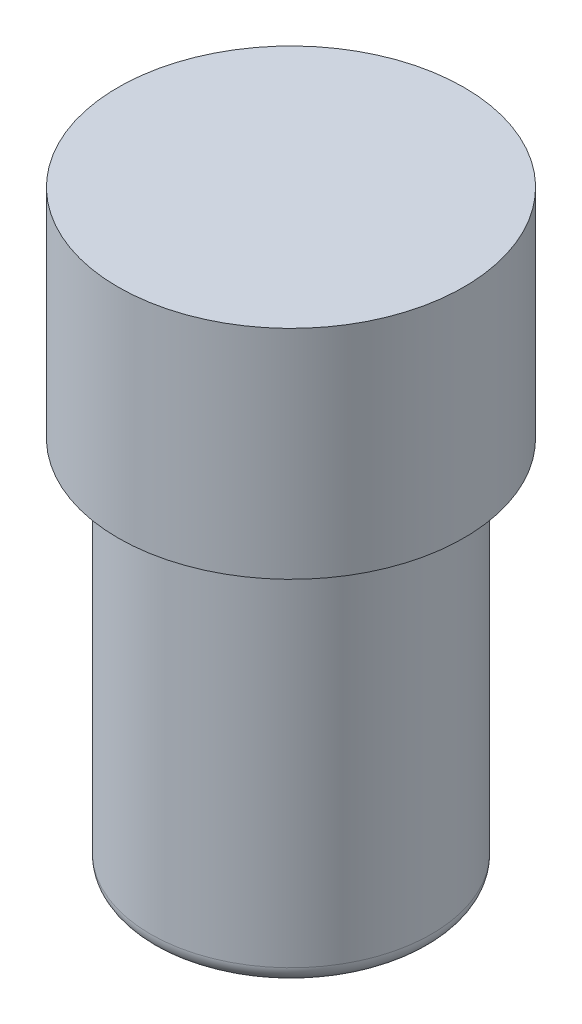
ISO-10303-21;
HEADER;
FILE_DESCRIPTION(('STEP AP214'),'2;1');
FILE_NAME('part.step','',(''),(''),'','','');
FILE_SCHEMA(('AUTOMOTIVE_DESIGN { 1 0 10303 214 1 1 1 1 }'));
ENDSEC;
DATA;
#1=APPLICATION_CONTEXT('core data for automotive mechanical design processes');
#2=APPLICATION_PROTOCOL_DEFINITION('international standard','automotive_design',2000,#1);
#3=PRODUCT_CONTEXT('',#1,'mechanical');
#4=PRODUCT('Part','Part','',(#3));
#5=PRODUCT_RELATED_PRODUCT_CATEGORY('part','',(#4));
#6=PRODUCT_DEFINITION_FORMATION('','',#4);
#7=PRODUCT_DEFINITION_CONTEXT('part definition',#1,'design');
#8=PRODUCT_DEFINITION('design','',#6,#7);
#9=PRODUCT_DEFINITION_SHAPE('','',#8);
#10=(LENGTH_UNIT() NAMED_UNIT(*) SI_UNIT(.MILLI.,.METRE.));
#11=(NAMED_UNIT(*) PLANE_ANGLE_UNIT() SI_UNIT($,.RADIAN.));
#12=(NAMED_UNIT(*) SI_UNIT($,.STERADIAN.) SOLID_ANGLE_UNIT());
#13=UNCERTAINTY_MEASURE_WITH_UNIT(LENGTH_MEASURE(1.E-05),#10,'distance_accuracy_value','');
#14=(GEOMETRIC_REPRESENTATION_CONTEXT(3) GLOBAL_UNCERTAINTY_ASSIGNED_CONTEXT((#13)) GLOBAL_UNIT_ASSIGNED_CONTEXT((#10,
#11,#12)) REPRESENTATION_CONTEXT('',''));
#15=CARTESIAN_POINT('',(0.,0.,0.));
#16=DIRECTION('',(0.,0.,1.));
#17=DIRECTION('',(1.,0.,0.));
#18=AXIS2_PLACEMENT_3D('',#15,#16,#17);
#19=CARTESIAN_POINT('',(0.,6.35,0.));
#20=DIRECTION('',(0.,-1.,0.));
#21=DIRECTION('',(0.,0.,-1.));
#22=AXIS2_PLACEMENT_3D('',#19,#20,#21);
#23=CYLINDRICAL_SURFACE('',#22,5.0535);
#24=CARTESIAN_POINT('',(0.,6.35,0.));
#25=DIRECTION('',(0.,1.,0.));
#26=DIRECTION('',(0.,0.,1.));
#27=AXIS2_PLACEMENT_3D('',#24,#25,#26);
#28=CIRCLE('',#27,5.0535);
#29=CARTESIAN_POINT('',(0.,6.35,5.0535));
#30=VERTEX_POINT('',#29);
#31=EDGE_CURVE('E53',#30,#30,#28,.T.);
#32=ORIENTED_EDGE('',*,*,#31,.F.);
#33=EDGE_LOOP('',(#32));
#34=FACE_BOUND('',#33,.T.);
#35=CARTESIAN_POINT('',(0.,0.,0.));
#36=DIRECTION('',(0.,1.,0.));
#37=DIRECTION('',(0.,0.,1.));
#38=AXIS2_PLACEMENT_3D('',#35,#36,#37);
#39=CIRCLE('',#38,5.0535);
#40=CARTESIAN_POINT('',(0.,0.,5.0535));
#41=VERTEX_POINT('',#40);
#42=EDGE_CURVE('E54',#41,#41,#39,.T.);
#43=ORIENTED_EDGE('',*,*,#42,.T.);
#44=EDGE_LOOP('',(#43));
#45=FACE_BOUND('',#44,.T.);
#46=ADVANCED_FACE('F33',(#34,#45),#23,.T.);
#47=CARTESIAN_POINT('',(0.,6.35,0.));
#48=DIRECTION('',(0.,1.,0.));
#49=DIRECTION('',(0.,0.,1.));
#50=AXIS2_PLACEMENT_3D('',#47,#48,#49);
#51=PLANE('',#50);
#52=ORIENTED_EDGE('',*,*,#31,.T.);
#53=EDGE_LOOP('',(#52));
#54=FACE_BOUND('',#53,.T.);
#55=ADVANCED_FACE('F60',(#54),#51,.T.);
#56=CARTESIAN_POINT('',(0.,0.,0.));
#57=DIRECTION('',(0.,1.,0.));
#58=DIRECTION('',(0.,0.,1.));
#59=AXIS2_PLACEMENT_3D('',#56,#57,#58);
#60=PLANE('',#59);
#61=CARTESIAN_POINT('',(0.,0.,0.));
#62=DIRECTION('',(0.,1.,0.));
#63=DIRECTION('',(0.,0.,1.));
#64=AXIS2_PLACEMENT_3D('',#61,#62,#63);
#65=CIRCLE('',#64,4.6047);
#66=CARTESIAN_POINT('',(0.,0.,4.6047));
#67=VERTEX_POINT('',#66);
#68=EDGE_CURVE('E48',#67,#67,#65,.T.);
#69=ORIENTED_EDGE('',*,*,#68,.T.);
#70=EDGE_LOOP('',(#69));
#71=FACE_BOUND('',#70,.T.);
#72=ORIENTED_EDGE('',*,*,#42,.F.);
#73=EDGE_LOOP('',(#72));
#74=FACE_BOUND('',#73,.T.);
#75=ADVANCED_FACE('F67',(#71,#74),#60,.F.);
#76=CARTESIAN_POINT('',(0.,-11.,0.));
#77=DIRECTION('',(0.,1.,0.));
#78=DIRECTION('',(0.,0.,1.));
#79=AXIS2_PLACEMENT_3D('',#76,#77,#78);
#80=CYLINDRICAL_SURFACE('',#79,4.1047);
#81=CARTESIAN_POINT('',(0.,-0.5,0.));
#82=DIRECTION('',(0.,1.,0.));
#83=DIRECTION('',(0.,0.,1.));
#84=AXIS2_PLACEMENT_3D('',#81,#82,#83);
#85=CIRCLE('',#84,4.1047);
#86=CARTESIAN_POINT('',(0.,-0.5,4.1047));
#87=VERTEX_POINT('',#86);
#88=EDGE_CURVE('E40',#87,#87,#85,.F.);
#89=ORIENTED_EDGE('',*,*,#88,.T.);
#90=EDGE_LOOP('',(#89));
#91=FACE_BOUND('',#90,.T.);
#92=CARTESIAN_POINT('',(0.,-10.5,0.));
#93=DIRECTION('',(0.,1.,0.));
#94=DIRECTION('',(0.,0.,1.));
#95=AXIS2_PLACEMENT_3D('',#92,#93,#94);
#96=CIRCLE('',#95,4.1047);
#97=CARTESIAN_POINT('',(0.,-10.5,4.1047));
#98=VERTEX_POINT('',#97);
#99=EDGE_CURVE('E44',#98,#98,#96,.T.);
#100=ORIENTED_EDGE('',*,*,#99,.T.);
#101=EDGE_LOOP('',(#100));
#102=FACE_BOUND('',#101,.T.);
#103=ADVANCED_FACE('F69',(#91,#102),#80,.T.);
#104=CARTESIAN_POINT('',(0.,-11.,0.));
#105=DIRECTION('',(0.,1.,0.));
#106=DIRECTION('',(0.,0.,1.));
#107=AXIS2_PLACEMENT_3D('',#104,#105,#106);
#108=PLANE('',#107);
#109=CARTESIAN_POINT('',(0.,-11.,0.));
#110=DIRECTION('',(0.,1.,0.));
#111=DIRECTION('',(0.,0.,1.));
#112=AXIS2_PLACEMENT_3D('',#109,#110,#111);
#113=CIRCLE('',#112,3.6047);
#114=CARTESIAN_POINT('',(0.,-11.,3.6047));
#115=VERTEX_POINT('',#114);
#116=EDGE_CURVE('E10',#115,#115,#113,.F.);
#117=ORIENTED_EDGE('',*,*,#116,.T.);
#118=EDGE_LOOP('',(#117));
#119=FACE_BOUND('',#118,.T.);
#120=ADVANCED_FACE('F76',(#119),#108,.F.);
#121=CARTESIAN_POINT('',(0.,-0.5,0.));
#122=DIRECTION('',(0.,1.,0.));
#123=DIRECTION('',(0.,0.,1.));
#124=AXIS2_PLACEMENT_3D('',#121,#122,#123);
#125=TOROIDAL_SURFACE('',#124,4.6047,0.5);
#126=ORIENTED_EDGE('',*,*,#88,.F.);
#127=EDGE_LOOP('',(#126));
#128=FACE_BOUND('',#127,.T.);
#129=ORIENTED_EDGE('',*,*,#68,.F.);
#130=EDGE_LOOP('',(#129));
#131=FACE_BOUND('',#130,.T.);
#132=ADVANCED_FACE('F79',(#128,#131),#125,.F.);
#133=CARTESIAN_POINT('',(0.,-10.5,0.));
#134=DIRECTION('',(0.,1.,0.));
#135=DIRECTION('',(0.,0.,1.));
#136=AXIS2_PLACEMENT_3D('',#133,#134,#135);
#137=TOROIDAL_SURFACE('',#136,3.6047,0.5);
#138=ORIENTED_EDGE('',*,*,#116,.F.);
#139=EDGE_LOOP('',(#138));
#140=FACE_BOUND('',#139,.T.);
#141=ORIENTED_EDGE('',*,*,#99,.F.);
#142=EDGE_LOOP('',(#141));
#143=FACE_BOUND('',#142,.T.);
#144=ADVANCED_FACE('F35',(#140,#143),#137,.T.);
#145=CLOSED_SHELL('',(#46,#55,#75,#103,#120,#132,#144));
#146=MANIFOLD_SOLID_BREP('B2',#145);
#147=ADVANCED_BREP_SHAPE_REPRESENTATION('',(#18,#146),#14);
#148=SHAPE_DEFINITION_REPRESENTATION(#9,#147);
ENDSEC;
END-ISO-10303-21;
